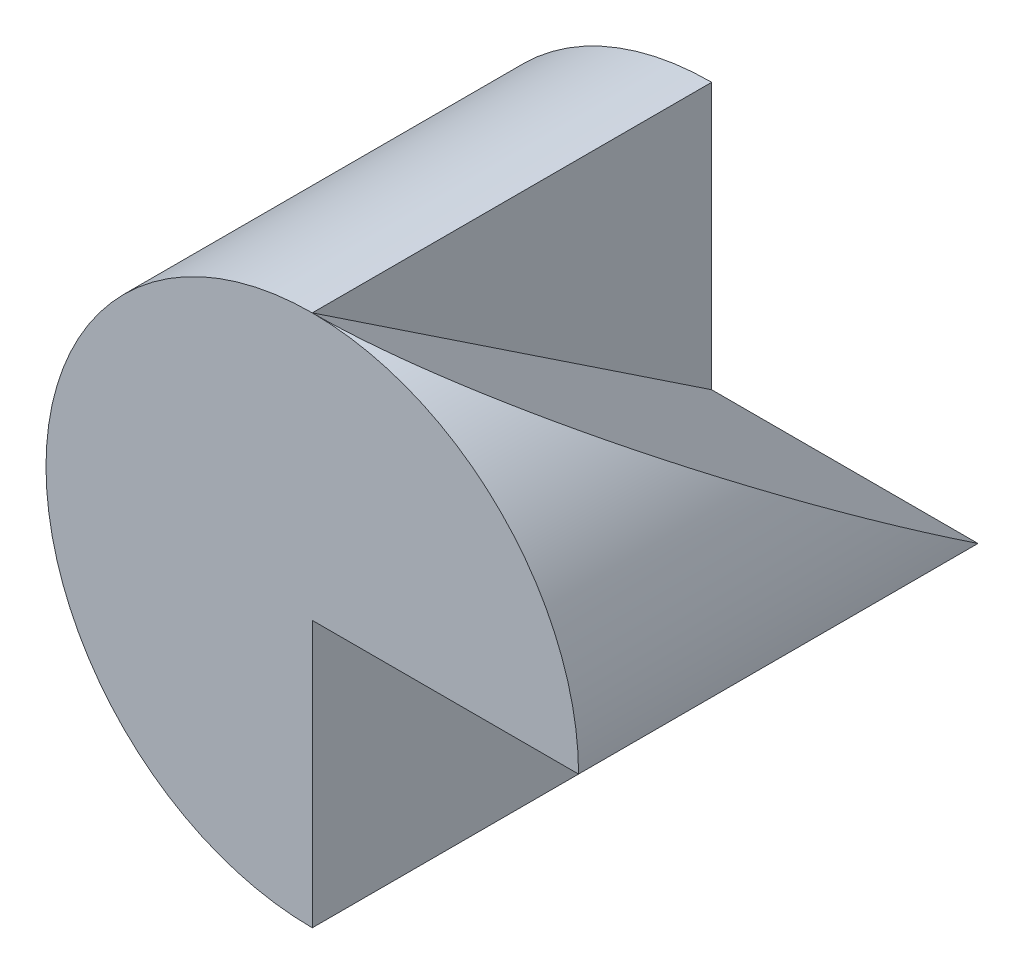
ISO-10303-21;
HEADER;
FILE_DESCRIPTION(('STEP AP214'),'2;1');
FILE_NAME('part.step','',(''),(''),'','','');
FILE_SCHEMA(('AUTOMOTIVE_DESIGN { 1 0 10303 214 1 1 1 1 }'));
ENDSEC;
DATA;
#1=APPLICATION_CONTEXT('core data for automotive mechanical design processes');
#2=APPLICATION_PROTOCOL_DEFINITION('international standard','automotive_design',2000,#1);
#3=PRODUCT_CONTEXT('',#1,'mechanical');
#4=PRODUCT('Part','Part','',(#3));
#5=PRODUCT_RELATED_PRODUCT_CATEGORY('part','',(#4));
#6=PRODUCT_DEFINITION_FORMATION('','',#4);
#7=PRODUCT_DEFINITION_CONTEXT('part definition',#1,'design');
#8=PRODUCT_DEFINITION('design','',#6,#7);
#9=PRODUCT_DEFINITION_SHAPE('','',#8);
#10=(LENGTH_UNIT() NAMED_UNIT(*) SI_UNIT(.MILLI.,.METRE.));
#11=(NAMED_UNIT(*) PLANE_ANGLE_UNIT() SI_UNIT($,.RADIAN.));
#12=(NAMED_UNIT(*) SI_UNIT($,.STERADIAN.) SOLID_ANGLE_UNIT());
#13=UNCERTAINTY_MEASURE_WITH_UNIT(LENGTH_MEASURE(1.E-05),#10,'distance_accuracy_value','');
#14=(GEOMETRIC_REPRESENTATION_CONTEXT(3) GLOBAL_UNCERTAINTY_ASSIGNED_CONTEXT((#13)) GLOBAL_UNIT_ASSIGNED_CONTEXT((#10,
#11,#12)) REPRESENTATION_CONTEXT('',''));
#15=CARTESIAN_POINT('',(0.,0.,0.));
#16=DIRECTION('',(0.,0.,1.));
#17=DIRECTION('',(1.,0.,0.));
#18=AXIS2_PLACEMENT_3D('',#15,#16,#17);
#19=CARTESIAN_POINT('',(0.,0.,15.));
#20=DIRECTION('',(0.,0.,-1.));
#21=DIRECTION('',(-1.,0.,0.));
#22=AXIS2_PLACEMENT_3D('',#19,#20,#21);
#23=CYLINDRICAL_SURFACE('',#22,10.);
#24=DIRECTION('',(0.,0.,1.));
#25=VECTOR('',#24,1.);
#26=CARTESIAN_POINT('',(0.,10.,0.));
#27=LINE('',#26,#25);
#28=CARTESIAN_POINT('',(0.,10.,0.));
#29=VERTEX_POINT('',#28);
#30=CARTESIAN_POINT('',(0.,10.,15.));
#31=VERTEX_POINT('',#30);
#32=EDGE_CURVE('E97',#29,#31,#27,.T.);
#33=ORIENTED_EDGE('',*,*,#32,.F.);
#34=CARTESIAN_POINT('',(0.,0.,0.));
#35=DIRECTION('',(0.,0.,1.));
#36=DIRECTION('',(1.,0.,0.));
#37=AXIS2_PLACEMENT_3D('',#34,#35,#36);
#38=CIRCLE('',#37,10.);
#39=CARTESIAN_POINT('',(0.,-10.,0.));
#40=VERTEX_POINT('',#39);
#41=EDGE_CURVE('E36',#29,#40,#38,.T.);
#42=ORIENTED_EDGE('',*,*,#41,.T.);
#43=DIRECTION('',(0.,0.,1.));
#44=VECTOR('',#43,1.);
#45=CARTESIAN_POINT('',(0.,-10.,0.));
#46=LINE('',#45,#44);
#47=CARTESIAN_POINT('',(0.,-10.,15.));
#48=VERTEX_POINT('',#47);
#49=EDGE_CURVE('E79',#40,#48,#46,.T.);
#50=ORIENTED_EDGE('',*,*,#49,.T.);
#51=CARTESIAN_POINT('',(0.,0.,15.));
#52=DIRECTION('',(0.,0.,1.));
#53=DIRECTION('',(1.,0.,0.));
#54=AXIS2_PLACEMENT_3D('',#51,#52,#53);
#55=CIRCLE('',#54,10.);
#56=EDGE_CURVE('E41',#31,#48,#55,.T.);
#57=ORIENTED_EDGE('',*,*,#56,.F.);
#58=EDGE_LOOP('',(#33,#42,#50,#57));
#59=FACE_BOUND('',#58,.T.);
#60=ADVANCED_FACE('F32',(#59),#23,.T.);
#61=CARTESIAN_POINT('',(0.,0.,0.));
#62=DIRECTION('',(0.,0.,1.));
#63=DIRECTION('',(1.,0.,0.));
#64=AXIS2_PLACEMENT_3D('',#61,#62,#63);
#65=PLANE('',#64);
#66=DIRECTION('',(0.,1.,0.));
#67=VECTOR('',#66,1.);
#68=CARTESIAN_POINT('',(0.,0.,0.));
#69=LINE('',#68,#67);
#70=CARTESIAN_POINT('',(0.,0.,0.));
#71=VERTEX_POINT('',#70);
#72=EDGE_CURVE('E100',#71,#29,#69,.T.);
#73=ORIENTED_EDGE('',*,*,#72,.F.);
#74=DIRECTION('',(0.,-1.,0.));
#75=VECTOR('',#74,1.);
#76=CARTESIAN_POINT('',(0.,0.,0.));
#77=LINE('',#76,#75);
#78=EDGE_CURVE('E90',#71,#40,#77,.T.);
#79=ORIENTED_EDGE('',*,*,#78,.T.);
#80=ORIENTED_EDGE('',*,*,#41,.F.);
#81=EDGE_LOOP('',(#73,#79,#80));
#82=FACE_BOUND('',#81,.T.);
#83=ADVANCED_FACE('F112',(#82),#65,.F.);
#84=DIRECTION('',(0.,0.,1.));
#85=VECTOR('',#84,1.);
#86=CARTESIAN_POINT('',(10.,0.,0.));
#87=LINE('',#86,#85);
#88=CARTESIAN_POINT('',(10.,0.,0.));
#89=VERTEX_POINT('',#88);
#90=CARTESIAN_POINT('',(10.,0.,15.));
#91=VERTEX_POINT('',#90);
#92=EDGE_CURVE('E87',#89,#91,#87,.T.);
#93=ORIENTED_EDGE('',*,*,#92,.F.);
#94=CARTESIAN_POINT('',(0.,0.,0.));
#95=DIRECTION('',(0.,-0.832050294337844,0.554700196225229));
#96=DIRECTION('',(0.,-0.554700196225229,-0.832050294337844));
#97=AXIS2_PLACEMENT_3D('',#94,#95,#96);
#98=ELLIPSE('',#97,18.0277563773199,10.);
#99=EDGE_CURVE('E56',#89,#31,#98,.T.);
#100=ORIENTED_EDGE('',*,*,#99,.T.);
#101=EDGE_CURVE('E11',#91,#31,#55,.T.);
#102=ORIENTED_EDGE('',*,*,#101,.F.);
#103=EDGE_LOOP('',(#93,#100,#102));
#104=FACE_BOUND('',#103,.T.);
#105=ADVANCED_FACE('F34',(#104),#23,.T.);
#106=CARTESIAN_POINT('',(0.,0.,15.));
#107=DIRECTION('',(0.,0.,1.));
#108=DIRECTION('',(1.,0.,0.));
#109=AXIS2_PLACEMENT_3D('',#106,#107,#108);
#110=PLANE('',#109);
#111=DIRECTION('',(0.,-1.,0.));
#112=VECTOR('',#111,1.);
#113=CARTESIAN_POINT('',(0.,0.,15.));
#114=LINE('',#113,#112);
#115=CARTESIAN_POINT('',(0.,0.,15.));
#116=VERTEX_POINT('',#115);
#117=EDGE_CURVE('E74',#116,#48,#114,.T.);
#118=ORIENTED_EDGE('',*,*,#117,.F.);
#119=DIRECTION('',(1.,0.,0.));
#120=VECTOR('',#119,1.);
#121=CARTESIAN_POINT('',(0.,0.,15.));
#122=LINE('',#121,#120);
#123=EDGE_CURVE('E85',#116,#91,#122,.T.);
#124=ORIENTED_EDGE('',*,*,#123,.T.);
#125=ORIENTED_EDGE('',*,*,#101,.T.);
#126=ORIENTED_EDGE('',*,*,#56,.T.);
#127=EDGE_LOOP('',(#118,#124,#125,#126));
#128=FACE_BOUND('',#127,.T.);
#129=ADVANCED_FACE('F72',(#128),#110,.T.);
#130=CARTESIAN_POINT('',(0.,0.,0.));
#131=DIRECTION('',(0.,-1.,0.));
#132=DIRECTION('',(0.,0.,-1.));
#133=AXIS2_PLACEMENT_3D('',#130,#131,#132);
#134=PLANE('',#133);
#135=ORIENTED_EDGE('',*,*,#123,.F.);
#136=DIRECTION('',(0.,0.,1.));
#137=VECTOR('',#136,1.);
#138=CARTESIAN_POINT('',(0.,0.,0.));
#139=LINE('',#138,#137);
#140=EDGE_CURVE('E82',#71,#116,#139,.T.);
#141=ORIENTED_EDGE('',*,*,#140,.F.);
#142=DIRECTION('',(1.,0.,0.));
#143=VECTOR('',#142,1.);
#144=CARTESIAN_POINT('',(0.,0.,0.));
#145=LINE('',#144,#143);
#146=EDGE_CURVE('E84',#71,#89,#145,.T.);
#147=ORIENTED_EDGE('',*,*,#146,.T.);
#148=ORIENTED_EDGE('',*,*,#92,.T.);
#149=EDGE_LOOP('',(#135,#141,#147,#148));
#150=FACE_BOUND('',#149,.T.);
#151=ADVANCED_FACE('F114',(#150),#134,.T.);
#152=CARTESIAN_POINT('',(0.,0.,0.));
#153=DIRECTION('',(-1.,0.,0.));
#154=DIRECTION('',(0.,0.,1.));
#155=AXIS2_PLACEMENT_3D('',#152,#153,#154);
#156=PLANE('',#155);
#157=ORIENTED_EDGE('',*,*,#117,.T.);
#158=ORIENTED_EDGE('',*,*,#49,.F.);
#159=ORIENTED_EDGE('',*,*,#78,.F.);
#160=ORIENTED_EDGE('',*,*,#140,.T.);
#161=EDGE_LOOP('',(#157,#158,#159,#160));
#162=FACE_BOUND('',#161,.T.);
#163=ADVANCED_FACE('F77',(#162),#156,.F.);
#164=CARTESIAN_POINT('',(0.,10.,15.));
#165=DIRECTION('',(0.,-0.832050294337844,0.554700196225229));
#166=DIRECTION('',(0.,-0.554700196225229,-0.832050294337844));
#167=AXIS2_PLACEMENT_3D('',#164,#165,#166);
#168=PLANE('',#167);
#169=ORIENTED_EDGE('',*,*,#146,.F.);
#170=DIRECTION('',(0.,-0.554700196225229,-0.832050294337844));
#171=VECTOR('',#170,1.);
#172=CARTESIAN_POINT('',(0.,10.,15.));
#173=LINE('',#172,#171);
#174=EDGE_CURVE('E103',#31,#71,#173,.T.);
#175=ORIENTED_EDGE('',*,*,#174,.F.);
#176=ORIENTED_EDGE('',*,*,#99,.F.);
#177=EDGE_LOOP('',(#169,#175,#176));
#178=FACE_BOUND('',#177,.T.);
#179=ADVANCED_FACE('F157',(#178),#168,.F.);
#180=CARTESIAN_POINT('',(0.,0.,0.));
#181=DIRECTION('',(1.,0.,0.));
#182=DIRECTION('',(0.,0.,-1.));
#183=AXIS2_PLACEMENT_3D('',#180,#181,#182);
#184=PLANE('',#183);
#185=ORIENTED_EDGE('',*,*,#174,.T.);
#186=ORIENTED_EDGE('',*,*,#72,.T.);
#187=ORIENTED_EDGE('',*,*,#32,.T.);
#188=EDGE_LOOP('',(#185,#186,#187));
#189=FACE_BOUND('',#188,.T.);
#190=ADVANCED_FACE('F108',(#189),#184,.T.);
#191=CLOSED_SHELL('',(#60,#83,#105,#129,#151,#163,#179,#190));
#192=MANIFOLD_SOLID_BREP('B2',#191);
#193=ADVANCED_BREP_SHAPE_REPRESENTATION('',(#18,#192),#14);
#194=SHAPE_DEFINITION_REPRESENTATION(#9,#193);
ENDSEC;
END-ISO-10303-21;
